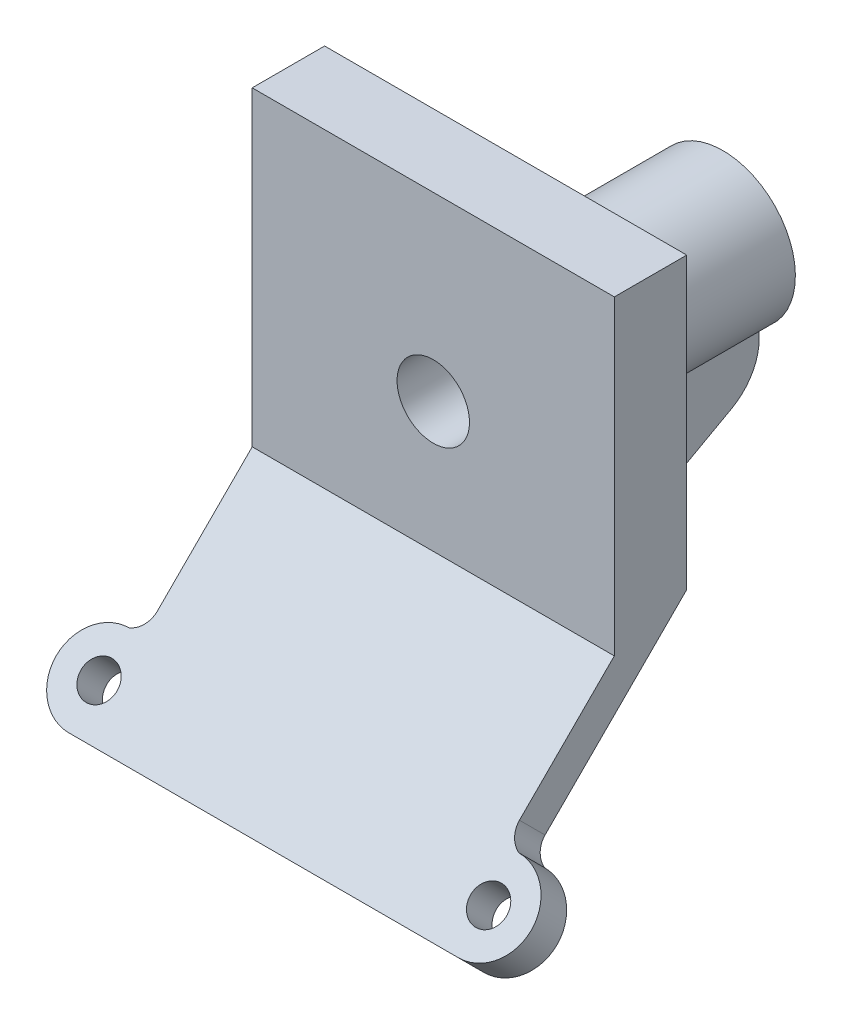
ISO-10303-21;
HEADER;
FILE_DESCRIPTION(('STEP AP214'),'2;1');
FILE_NAME('part.step','',(''),(''),'','','');
FILE_SCHEMA(('AUTOMOTIVE_DESIGN { 1 0 10303 214 1 1 1 1 }'));
ENDSEC;
DATA;
#1=APPLICATION_CONTEXT('core data for automotive mechanical design processes');
#2=APPLICATION_PROTOCOL_DEFINITION('international standard','automotive_design',2000,#1);
#3=PRODUCT_CONTEXT('',#1,'mechanical');
#4=PRODUCT('Part','Part','',(#3));
#5=PRODUCT_RELATED_PRODUCT_CATEGORY('part','',(#4));
#6=PRODUCT_DEFINITION_FORMATION('','',#4);
#7=PRODUCT_DEFINITION_CONTEXT('part definition',#1,'design');
#8=PRODUCT_DEFINITION('design','',#6,#7);
#9=PRODUCT_DEFINITION_SHAPE('','',#8);
#10=(LENGTH_UNIT() NAMED_UNIT(*) SI_UNIT(.MILLI.,.METRE.));
#11=(NAMED_UNIT(*) PLANE_ANGLE_UNIT() SI_UNIT($,.RADIAN.));
#12=(NAMED_UNIT(*) SI_UNIT($,.STERADIAN.) SOLID_ANGLE_UNIT());
#13=UNCERTAINTY_MEASURE_WITH_UNIT(LENGTH_MEASURE(1.E-05),#10,'distance_accuracy_value','');
#14=(GEOMETRIC_REPRESENTATION_CONTEXT(3) GLOBAL_UNCERTAINTY_ASSIGNED_CONTEXT((#13)) GLOBAL_UNIT_ASSIGNED_CONTEXT((#10,
#11,#12)) REPRESENTATION_CONTEXT('',''));
#15=CARTESIAN_POINT('',(0.,0.,0.));
#16=DIRECTION('',(0.,0.,1.));
#17=DIRECTION('',(1.,0.,0.));
#18=AXIS2_PLACEMENT_3D('',#15,#16,#17);
#19=CARTESIAN_POINT('',(25.,50.,5.));
#20=DIRECTION('',(-1.,0.,0.));
#21=DIRECTION('',(0.,-1.,0.));
#22=AXIS2_PLACEMENT_3D('',#19,#20,#21);
#23=PLANE('',#22);
#24=DIRECTION('',(0.,-0.707106781186546,0.707106781186549));
#25=VECTOR('',#24,1.);
#26=CARTESIAN_POINT('',(25.,2.5,2.49999999999999));
#27=LINE('',#26,#25);
#28=CARTESIAN_POINT('',(25.,9.99999999999997,-5.00000000000001));
#29=VERTEX_POINT('',#28);
#30=CARTESIAN_POINT('',(25.,-9.56377576521511,14.5637757652152));
#31=VERTEX_POINT('',#30);
#32=EDGE_CURVE('E229',#29,#31,#27,.T.);
#33=ORIENTED_EDGE('',*,*,#32,.F.);
#34=DIRECTION('',(0.,1.,0.));
#35=VECTOR('',#34,1.);
#36=CARTESIAN_POINT('',(25.,50.,-5.));
#37=LINE('',#36,#35);
#38=CARTESIAN_POINT('',(25.,50.,-5.));
#39=VERTEX_POINT('',#38);
#40=EDGE_CURVE('E287',#29,#39,#37,.T.);
#41=ORIENTED_EDGE('',*,*,#40,.T.);
#42=DIRECTION('',(0.,0.,-1.));
#43=VECTOR('',#42,1.);
#44=CARTESIAN_POINT('',(25.,50.,5.));
#45=LINE('',#44,#43);
#46=CARTESIAN_POINT('',(25.,50.,5.));
#47=VERTEX_POINT('',#46);
#48=EDGE_CURVE('E291',#47,#39,#45,.T.);
#49=ORIENTED_EDGE('',*,*,#48,.F.);
#50=DIRECTION('',(0.,1.,0.));
#51=VECTOR('',#50,1.);
#52=CARTESIAN_POINT('',(25.,50.,5.));
#53=LINE('',#52,#51);
#54=CARTESIAN_POINT('',(25.,7.07106781186547,5.));
#55=VERTEX_POINT('',#54);
#56=EDGE_CURVE('E292',#55,#47,#53,.T.);
#57=ORIENTED_EDGE('',*,*,#56,.F.);
#58=DIRECTION('',(0.,-0.707106781186546,0.707106781186549));
#59=VECTOR('',#58,1.);
#60=CARTESIAN_POINT('',(25.,48.1938279161411,-36.1227601042758));
#61=LINE('',#60,#59);
#62=CARTESIAN_POINT('',(25.,-6.02824185928237,18.0993096711479));
#63=VERTEX_POINT('',#62);
#64=EDGE_CURVE('E276',#55,#63,#61,.T.);
#65=ORIENTED_EDGE('',*,*,#64,.T.);
#66=DIRECTION('',(0.,-0.707106781186549,-0.707106781186546));
#67=VECTOR('',#66,1.);
#68=CARTESIAN_POINT('',(25.,-6.02824185928237,18.0993096711479));
#69=LINE('',#68,#67);
#70=EDGE_CURVE('E239',#63,#31,#69,.T.);
#71=ORIENTED_EDGE('',*,*,#70,.T.);
#72=EDGE_LOOP('',(#33,#41,#49,#57,#65,#71));
#73=FACE_BOUND('',#72,.T.);
#74=ADVANCED_FACE('F37',(#73),#23,.F.);
#75=CARTESIAN_POINT('',(-25.,50.,5.));
#76=DIRECTION('',(0.,-1.,0.));
#77=DIRECTION('',(0.,0.,-1.));
#78=AXIS2_PLACEMENT_3D('',#75,#76,#77);
#79=PLANE('',#78);
#80=DIRECTION('',(-1.,0.,0.));
#81=VECTOR('',#80,1.);
#82=CARTESIAN_POINT('',(-25.,50.,-5.));
#83=LINE('',#82,#81);
#84=CARTESIAN_POINT('',(-25.,50.,-5.));
#85=VERTEX_POINT('',#84);
#86=EDGE_CURVE('E302',#39,#85,#83,.T.);
#87=ORIENTED_EDGE('',*,*,#86,.T.);
#88=DIRECTION('',(0.,0.,-1.));
#89=VECTOR('',#88,1.);
#90=CARTESIAN_POINT('',(-25.,50.,5.));
#91=LINE('',#90,#89);
#92=CARTESIAN_POINT('',(-25.,50.,5.));
#93=VERTEX_POINT('',#92);
#94=EDGE_CURVE('E300',#93,#85,#91,.T.);
#95=ORIENTED_EDGE('',*,*,#94,.F.);
#96=DIRECTION('',(-1.,0.,0.));
#97=VECTOR('',#96,1.);
#98=CARTESIAN_POINT('',(-25.,50.,5.));
#99=LINE('',#98,#97);
#100=EDGE_CURVE('E294',#47,#93,#99,.T.);
#101=ORIENTED_EDGE('',*,*,#100,.F.);
#102=ORIENTED_EDGE('',*,*,#48,.T.);
#103=EDGE_LOOP('',(#87,#95,#101,#102));
#104=FACE_BOUND('',#103,.T.);
#105=ADVANCED_FACE('F344',(#104),#79,.F.);
#106=CARTESIAN_POINT('',(-25.,0.,5.));
#107=DIRECTION('',(1.,0.,0.));
#108=DIRECTION('',(0.,1.,0.));
#109=AXIS2_PLACEMENT_3D('',#106,#107,#108);
#110=PLANE('',#109);
#111=DIRECTION('',(0.,-1.,0.));
#112=VECTOR('',#111,1.);
#113=CARTESIAN_POINT('',(-25.,0.,-5.));
#114=LINE('',#113,#112);
#115=CARTESIAN_POINT('',(-25.,9.99999999999998,-5.00000000000001));
#116=VERTEX_POINT('',#115);
#117=EDGE_CURVE('E295',#85,#116,#114,.T.);
#118=ORIENTED_EDGE('',*,*,#117,.T.);
#119=DIRECTION('',(0.,-0.707106781186546,0.707106781186549));
#120=VECTOR('',#119,1.);
#121=CARTESIAN_POINT('',(-25.,2.5,2.49999999999999));
#122=LINE('',#121,#120);
#123=CARTESIAN_POINT('',(-25.,-9.56377576521511,14.5637757652152));
#124=VERTEX_POINT('',#123);
#125=EDGE_CURVE('E240',#116,#124,#122,.T.);
#126=ORIENTED_EDGE('',*,*,#125,.T.);
#127=DIRECTION('',(0.,-0.707106781186549,-0.707106781186546));
#128=VECTOR('',#127,1.);
#129=CARTESIAN_POINT('',(-25.,-6.02824185928237,18.0993096711479));
#130=LINE('',#129,#128);
#131=CARTESIAN_POINT('',(-25.,-6.02824185928237,18.0993096711479));
#132=VERTEX_POINT('',#131);
#133=EDGE_CURVE('E269',#132,#124,#130,.T.);
#134=ORIENTED_EDGE('',*,*,#133,.F.);
#135=DIRECTION('',(0.,-0.707106781186546,0.707106781186549));
#136=VECTOR('',#135,1.);
#137=CARTESIAN_POINT('',(-25.,48.1938279161411,-36.1227601042758));
#138=LINE('',#137,#136);
#139=CARTESIAN_POINT('',(-25.,7.07106781186546,5.));
#140=VERTEX_POINT('',#139);
#141=EDGE_CURVE('E274',#140,#132,#138,.T.);
#142=ORIENTED_EDGE('',*,*,#141,.F.);
#143=DIRECTION('',(0.,-1.,0.));
#144=VECTOR('',#143,1.);
#145=CARTESIAN_POINT('',(-25.,0.,5.));
#146=LINE('',#145,#144);
#147=EDGE_CURVE('E297',#93,#140,#146,.T.);
#148=ORIENTED_EDGE('',*,*,#147,.F.);
#149=ORIENTED_EDGE('',*,*,#94,.T.);
#150=EDGE_LOOP('',(#118,#126,#134,#142,#148,#149));
#151=FACE_BOUND('',#150,.T.);
#152=ADVANCED_FACE('F350',(#151),#110,.F.);
#153=CARTESIAN_POINT('',(0.,0.,5.));
#154=DIRECTION('',(0.,0.,-1.));
#155=DIRECTION('',(-1.,0.,0.));
#156=AXIS2_PLACEMENT_3D('',#153,#154,#155);
#157=PLANE('',#156);
#158=CARTESIAN_POINT('',(0.,25.,5.));
#159=DIRECTION('',(0.,0.,1.));
#160=DIRECTION('',(1.,0.,0.));
#161=AXIS2_PLACEMENT_3D('',#158,#159,#160);
#162=CIRCLE('',#161,5.);
#163=CARTESIAN_POINT('',(5.,25.,5.));
#164=VERTEX_POINT('',#163);
#165=EDGE_CURVE('E278',#164,#164,#162,.T.);
#166=ORIENTED_EDGE('',*,*,#165,.F.);
#167=EDGE_LOOP('',(#166));
#168=FACE_BOUND('',#167,.T.);
#169=ORIENTED_EDGE('',*,*,#100,.T.);
#170=ORIENTED_EDGE('',*,*,#147,.T.);
#171=DIRECTION('',(1.,0.,0.));
#172=VECTOR('',#171,1.);
#173=CARTESIAN_POINT('',(-25.,7.07106781186547,5.));
#174=LINE('',#173,#172);
#175=EDGE_CURVE('E272',#140,#55,#174,.T.);
#176=ORIENTED_EDGE('',*,*,#175,.T.);
#177=ORIENTED_EDGE('',*,*,#56,.T.);
#178=EDGE_LOOP('',(#169,#170,#176,#177));
#179=FACE_BOUND('',#178,.T.);
#180=ADVANCED_FACE('F367',(#168,#179),#157,.F.);
#181=CARTESIAN_POINT('',(0.,0.,-5.));
#182=DIRECTION('',(0.,0.,-1.));
#183=DIRECTION('',(-1.,0.,0.));
#184=AXIS2_PLACEMENT_3D('',#181,#182,#183);
#185=PLANE('',#184);
#186=DIRECTION('',(0.,-1.,0.));
#187=VECTOR('',#186,1.);
#188=CARTESIAN_POINT('',(5.,0.,-5.));
#189=LINE('',#188,#187);
#190=CARTESIAN_POINT('',(5.,16.3397459621556,-5.));
#191=VERTEX_POINT('',#190);
#192=CARTESIAN_POINT('',(5.,9.99999999999997,-5.));
#193=VERTEX_POINT('',#192);
#194=EDGE_CURVE('E212',#191,#193,#189,.T.);
#195=ORIENTED_EDGE('',*,*,#194,.F.);
#196=CARTESIAN_POINT('',(0.,25.,-5.));
#197=DIRECTION('',(0.,0.,-1.));
#198=DIRECTION('',(-1.,0.,0.));
#199=AXIS2_PLACEMENT_3D('',#196,#197,#198);
#200=CIRCLE('',#199,10.);
#201=CARTESIAN_POINT('',(-5.,16.3397459621556,-5.));
#202=VERTEX_POINT('',#201);
#203=EDGE_CURVE('E288',#202,#191,#200,.T.);
#204=ORIENTED_EDGE('',*,*,#203,.F.);
#205=DIRECTION('',(0.,-1.,0.));
#206=VECTOR('',#205,1.);
#207=CARTESIAN_POINT('',(-5.,0.,-5.));
#208=LINE('',#207,#206);
#209=CARTESIAN_POINT('',(-5.,9.99999999999997,-5.00000000000001));
#210=VERTEX_POINT('',#209);
#211=EDGE_CURVE('E205',#202,#210,#208,.T.);
#212=ORIENTED_EDGE('',*,*,#211,.T.);
#213=DIRECTION('',(1.,0.,0.));
#214=VECTOR('',#213,1.);
#215=CARTESIAN_POINT('',(0.,9.99999999999997,-5.));
#216=LINE('',#215,#214);
#217=EDGE_CURVE('E310',#116,#210,#216,.T.);
#218=ORIENTED_EDGE('',*,*,#217,.F.);
#219=ORIENTED_EDGE('',*,*,#117,.F.);
#220=ORIENTED_EDGE('',*,*,#86,.F.);
#221=ORIENTED_EDGE('',*,*,#40,.F.);
#222=EDGE_CURVE('E290',#193,#29,#216,.T.);
#223=ORIENTED_EDGE('',*,*,#222,.F.);
#224=EDGE_LOOP('',(#195,#204,#212,#218,#219,#220,#221,#223));
#225=FACE_BOUND('',#224,.T.);
#226=ADVANCED_FACE('F359',(#225),#185,.T.);
#227=CARTESIAN_POINT('',(0.,25.,-35.));
#228=DIRECTION('',(0.,0.,1.));
#229=DIRECTION('',(1.,0.,0.));
#230=AXIS2_PLACEMENT_3D('',#227,#228,#229);
#231=CYLINDRICAL_SURFACE('',#230,10.);
#232=ORIENTED_EDGE('',*,*,#203,.T.);
#233=DIRECTION('',(0.,0.,1.));
#234=VECTOR('',#233,1.);
#235=CARTESIAN_POINT('',(5.,16.3397459621556,-35.));
#236=LINE('',#235,#234);
#237=CARTESIAN_POINT('',(5.,16.3397459621556,-34.9919759113786));
#238=VERTEX_POINT('',#237);
#239=EDGE_CURVE('E51',#191,#238,#236,.F.);
#240=ORIENTED_EDGE('',*,*,#239,.T.);
#241=CARTESIAN_POINT('',(0.,25.,-34.9382764772955));
#242=DIRECTION('',(0.,0.00620055734505954,-0.999980776359531));
#243=DIRECTION('',(0.,0.999980776359531,0.00620055734505954));
#244=AXIS2_PLACEMENT_3D('',#241,#242,#243);
#245=ELLIPSE('',#244,10.0001922401002,10.);
#246=CARTESIAN_POINT('',(0.954725076891164,15.0456793286756,-35.));
#247=VERTEX_POINT('',#246);
#248=EDGE_CURVE('E216',#238,#247,#245,.T.);
#249=ORIENTED_EDGE('',*,*,#248,.T.);
#250=CARTESIAN_POINT('',(0.,25.,-35.));
#251=DIRECTION('',(0.,0.,-1.));
#252=DIRECTION('',(-1.,0.,0.));
#253=AXIS2_PLACEMENT_3D('',#250,#251,#252);
#254=CIRCLE('',#253,10.);
#255=CARTESIAN_POINT('',(-0.954725076891164,15.0456793286756,-35.));
#256=VERTEX_POINT('',#255);
#257=EDGE_CURVE('E282',#256,#247,#254,.T.);
#258=ORIENTED_EDGE('',*,*,#257,.F.);
#259=CARTESIAN_POINT('',(-5.,16.3397459621556,-34.9919759113786));
#260=VERTEX_POINT('',#259);
#261=EDGE_CURVE('E58',#256,#260,#245,.T.);
#262=ORIENTED_EDGE('',*,*,#261,.T.);
#263=DIRECTION('',(0.,0.,1.));
#264=VECTOR('',#263,1.);
#265=CARTESIAN_POINT('',(-5.,16.3397459621556,-35.));
#266=LINE('',#265,#264);
#267=EDGE_CURVE('E210',#202,#260,#266,.F.);
#268=ORIENTED_EDGE('',*,*,#267,.F.);
#269=EDGE_LOOP('',(#232,#240,#249,#258,#262,#268));
#270=FACE_BOUND('',#269,.T.);
#271=ADVANCED_FACE('F406',(#270),#231,.T.);
#272=CARTESIAN_POINT('',(0.,25.,-35.));
#273=DIRECTION('',(0.,0.,-1.));
#274=DIRECTION('',(-1.,0.,0.));
#275=AXIS2_PLACEMENT_3D('',#272,#273,#274);
#276=PLANE('',#275);
#277=DIRECTION('',(1.,0.,0.));
#278=VECTOR('',#277,1.);
#279=CARTESIAN_POINT('',(0.,15.0456793286756,-35.));
#280=LINE('',#279,#278);
#281=EDGE_CURVE('E190',#256,#247,#280,.T.);
#282=ORIENTED_EDGE('',*,*,#281,.F.);
#283=ORIENTED_EDGE('',*,*,#257,.T.);
#284=EDGE_LOOP('',(#282,#283));
#285=FACE_BOUND('',#284,.T.);
#286=CARTESIAN_POINT('',(0.,25.,-35.));
#287=DIRECTION('',(0.,0.,1.));
#288=DIRECTION('',(1.,0.,0.));
#289=AXIS2_PLACEMENT_3D('',#286,#287,#288);
#290=CIRCLE('',#289,5.);
#291=CARTESIAN_POINT('',(5.,25.,-35.));
#292=VERTEX_POINT('',#291);
#293=EDGE_CURVE('E279',#292,#292,#290,.T.);
#294=ORIENTED_EDGE('',*,*,#293,.T.);
#295=EDGE_LOOP('',(#294));
#296=FACE_BOUND('',#295,.T.);
#297=ADVANCED_FACE('F410',(#285,#296),#276,.T.);
#298=CARTESIAN_POINT('',(0.,25.,-35.));
#299=DIRECTION('',(0.,0.,1.));
#300=DIRECTION('',(1.,0.,0.));
#301=AXIS2_PLACEMENT_3D('',#298,#299,#300);
#302=CYLINDRICAL_SURFACE('',#301,5.);
#303=ORIENTED_EDGE('',*,*,#293,.F.);
#304=EDGE_LOOP('',(#303));
#305=FACE_BOUND('',#304,.T.);
#306=ORIENTED_EDGE('',*,*,#165,.T.);
#307=EDGE_LOOP('',(#306));
#308=FACE_BOUND('',#307,.T.);
#309=ADVANCED_FACE('F413',(#305,#308),#302,.F.);
#310=CARTESIAN_POINT('',(-25.,48.1938279161411,-36.1227601042758));
#311=DIRECTION('',(0.,-0.707106781186549,-0.707106781186546));
#312=DIRECTION('',(0.,0.707106781186546,-0.707106781186549));
#313=AXIS2_PLACEMENT_3D('',#310,#311,#312);
#314=PLANE('',#313);
#315=CARTESIAN_POINT('',(26.8946348603925,-12.1799543555879,24.2510221674534));
#316=DIRECTION('',(0.,-0.707106781186549,-0.707106781186546));
#317=DIRECTION('',(0.,-0.707106781186546,0.707106781186549));
#318=AXIS2_PLACEMENT_3D('',#315,#316,#317);
#319=CIRCLE('',#318,2.5);
#320=CARTESIAN_POINT('',(26.8946348603925,-13.9477213085542,26.0187891204198));
#321=VERTEX_POINT('',#320);
#322=EDGE_CURVE('E218',#321,#321,#319,.T.);
#323=ORIENTED_EDGE('',*,*,#322,.T.);
#324=EDGE_LOOP('',(#323));
#325=FACE_BOUND('',#324,.T.);
#326=ORIENTED_EDGE('',*,*,#64,.F.);
#327=ORIENTED_EDGE('',*,*,#175,.F.);
#328=ORIENTED_EDGE('',*,*,#141,.T.);
#329=CARTESIAN_POINT('',(-28.,-6.02824185928237,18.0993096711479));
#330=DIRECTION('',(0.,0.707106781186549,0.707106781186546));
#331=DIRECTION('',(0.,-0.707106781186546,0.707106781186549));
#332=AXIS2_PLACEMENT_3D('',#329,#330,#331);
#333=CIRCLE('',#332,3.);
#334=CARTESIAN_POINT('',(-26.8946348603925,-8.00031791107909,20.0713857229446));
#335=VERTEX_POINT('',#334);
#336=EDGE_CURVE('E226',#132,#335,#333,.F.);
#337=ORIENTED_EDGE('',*,*,#336,.T.);
#338=CARTESIAN_POINT('',(-26.8946348603925,-12.1799543555879,24.2510221674534));
#339=DIRECTION('',(0.,0.707106781186549,0.707106781186546));
#340=DIRECTION('',(0.,-0.707106781186546,0.707106781186549));
#341=AXIS2_PLACEMENT_3D('',#338,#339,#340);
#342=CIRCLE('',#341,5.91089854561318);
#343=CARTESIAN_POINT('',(-26.8946348603925,-16.3595908000966,28.4306586119622));
#344=VERTEX_POINT('',#343);
#345=EDGE_CURVE('E228',#335,#344,#342,.T.);
#346=ORIENTED_EDGE('',*,*,#345,.T.);
#347=DIRECTION('',(1.,0.,0.));
#348=VECTOR('',#347,1.);
#349=CARTESIAN_POINT('',(0.,-16.3595908000966,28.4306586119622));
#350=LINE('',#349,#348);
#351=CARTESIAN_POINT('',(26.8946348603925,-16.3595908000966,28.4306586119622));
#352=VERTEX_POINT('',#351);
#353=EDGE_CURVE('E231',#344,#352,#350,.T.);
#354=ORIENTED_EDGE('',*,*,#353,.T.);
#355=CARTESIAN_POINT('',(26.8946348603925,-12.1799543555879,24.2510221674534));
#356=DIRECTION('',(0.,0.707106781186549,0.707106781186546));
#357=DIRECTION('',(0.,-0.707106781186546,0.707106781186549));
#358=AXIS2_PLACEMENT_3D('',#355,#356,#357);
#359=CIRCLE('',#358,5.91089854561318);
#360=CARTESIAN_POINT('',(26.8946348603925,-8.00031791107909,20.0713857229446));
#361=VERTEX_POINT('',#360);
#362=EDGE_CURVE('E233',#361,#352,#359,.F.);
#363=ORIENTED_EDGE('',*,*,#362,.F.);
#364=CARTESIAN_POINT('',(28.,-6.02824185928237,18.0993096711479));
#365=DIRECTION('',(0.,0.707106781186549,0.707106781186546));
#366=DIRECTION('',(0.,-0.707106781186546,0.707106781186549));
#367=AXIS2_PLACEMENT_3D('',#364,#365,#366);
#368=CIRCLE('',#367,3.);
#369=EDGE_CURVE('E236',#63,#361,#368,.T.);
#370=ORIENTED_EDGE('',*,*,#369,.F.);
#371=EDGE_LOOP('',(#326,#327,#328,#337,#346,#354,#363,#370));
#372=FACE_BOUND('',#371,.T.);
#373=CARTESIAN_POINT('',(-26.8946348603925,-12.1799543555879,24.2510221674534));
#374=DIRECTION('',(0.,0.707106781186549,0.707106781186546));
#375=DIRECTION('',(0.,-0.707106781186546,0.707106781186549));
#376=AXIS2_PLACEMENT_3D('',#373,#374,#375);
#377=CIRCLE('',#376,2.5);
#378=CARTESIAN_POINT('',(-26.8946348603925,-13.9477213085542,26.0187891204198));
#379=VERTEX_POINT('',#378);
#380=EDGE_CURVE('E222',#379,#379,#377,.T.);
#381=ORIENTED_EDGE('',*,*,#380,.F.);
#382=EDGE_LOOP('',(#381));
#383=FACE_BOUND('',#382,.T.);
#384=ADVANCED_FACE('F372',(#325,#372,#383),#314,.F.);
#385=CARTESIAN_POINT('',(-28.,-6.02824185928237,18.0993096711479));
#386=DIRECTION('',(0.,-0.707106781186549,-0.707106781186546));
#387=DIRECTION('',(0.,0.707106781186546,-0.707106781186549));
#388=AXIS2_PLACEMENT_3D('',#385,#386,#387);
#389=CYLINDRICAL_SURFACE('',#388,3.);
#390=CARTESIAN_POINT('',(-28.,-9.56377576521511,14.5637757652151));
#391=DIRECTION('',(0.,0.707106781186549,0.707106781186546));
#392=DIRECTION('',(0.,-0.707106781186546,0.707106781186549));
#393=AXIS2_PLACEMENT_3D('',#390,#391,#392);
#394=CIRCLE('',#393,3.);
#395=CARTESIAN_POINT('',(-26.8946348603925,-11.5358518170118,16.5358518170119));
#396=VERTEX_POINT('',#395);
#397=EDGE_CURVE('E243',#124,#396,#394,.F.);
#398=ORIENTED_EDGE('',*,*,#397,.T.);
#399=DIRECTION('',(0.,-0.707106781186549,-0.707106781186546));
#400=VECTOR('',#399,1.);
#401=CARTESIAN_POINT('',(-26.8946348603925,-8.00031791107909,20.0713857229446));
#402=LINE('',#401,#400);
#403=EDGE_CURVE('E266',#335,#396,#402,.T.);
#404=ORIENTED_EDGE('',*,*,#403,.F.);
#405=ORIENTED_EDGE('',*,*,#336,.F.);
#406=ORIENTED_EDGE('',*,*,#133,.T.);
#407=EDGE_LOOP('',(#398,#404,#405,#406));
#408=FACE_BOUND('',#407,.T.);
#409=ADVANCED_FACE('F394',(#408),#389,.F.);
#410=CARTESIAN_POINT('',(-26.8946348603925,-12.1799543555879,24.2510221674534));
#411=DIRECTION('',(0.,-0.707106781186549,-0.707106781186546));
#412=DIRECTION('',(0.,0.707106781186546,-0.707106781186549));
#413=AXIS2_PLACEMENT_3D('',#410,#411,#412);
#414=CYLINDRICAL_SURFACE('',#413,5.91089854561318);
#415=CARTESIAN_POINT('',(-26.8946348603925,-15.7154882615206,20.7154882615207));
#416=DIRECTION('',(0.,0.707106781186549,0.707106781186546));
#417=DIRECTION('',(0.,-0.707106781186546,0.707106781186549));
#418=AXIS2_PLACEMENT_3D('',#415,#416,#417);
#419=CIRCLE('',#418,5.91089854561318);
#420=CARTESIAN_POINT('',(-26.8946348603925,-19.8951247060294,24.8951247060295));
#421=VERTEX_POINT('',#420);
#422=EDGE_CURVE('E245',#396,#421,#419,.T.);
#423=ORIENTED_EDGE('',*,*,#422,.T.);
#424=DIRECTION('',(0.,-0.707106781186549,-0.707106781186546));
#425=VECTOR('',#424,1.);
#426=CARTESIAN_POINT('',(-26.8946348603925,-16.3595908000966,28.4306586119622));
#427=LINE('',#426,#425);
#428=EDGE_CURVE('E263',#344,#421,#427,.T.);
#429=ORIENTED_EDGE('',*,*,#428,.F.);
#430=ORIENTED_EDGE('',*,*,#345,.F.);
#431=ORIENTED_EDGE('',*,*,#403,.T.);
#432=EDGE_LOOP('',(#423,#429,#430,#431));
#433=FACE_BOUND('',#432,.T.);
#434=ADVANCED_FACE('F389',(#433),#414,.T.);
#435=CARTESIAN_POINT('',(0.,-16.3595908000966,28.4306586119622));
#436=DIRECTION('',(0.,0.707106781186546,-0.707106781186549));
#437=DIRECTION('',(0.,0.707106781186549,0.707106781186546));
#438=AXIS2_PLACEMENT_3D('',#435,#436,#437);
#439=PLANE('',#438);
#440=DIRECTION('',(0.,-0.707106781186549,-0.707106781186546));
#441=VECTOR('',#440,1.);
#442=CARTESIAN_POINT('',(26.8946348603925,-16.3595908000966,28.4306586119622));
#443=LINE('',#442,#441);
#444=CARTESIAN_POINT('',(26.8946348603925,-19.8951247060294,24.8951247060295));
#445=VERTEX_POINT('',#444);
#446=EDGE_CURVE('E261',#352,#445,#443,.T.);
#447=ORIENTED_EDGE('',*,*,#446,.F.);
#448=ORIENTED_EDGE('',*,*,#353,.F.);
#449=ORIENTED_EDGE('',*,*,#428,.T.);
#450=DIRECTION('',(1.,0.,0.));
#451=VECTOR('',#450,1.);
#452=CARTESIAN_POINT('',(0.,-19.8951247060294,24.8951247060295));
#453=LINE('',#452,#451);
#454=EDGE_CURVE('E247',#421,#445,#453,.T.);
#455=ORIENTED_EDGE('',*,*,#454,.T.);
#456=EDGE_LOOP('',(#447,#448,#449,#455));
#457=FACE_BOUND('',#456,.T.);
#458=ADVANCED_FACE('F385',(#457),#439,.F.);
#459=CARTESIAN_POINT('',(26.8946348603925,-12.1799543555879,24.2510221674534));
#460=DIRECTION('',(0.,-0.707106781186549,-0.707106781186546));
#461=DIRECTION('',(0.,0.707106781186546,-0.707106781186549));
#462=AXIS2_PLACEMENT_3D('',#459,#460,#461);
#463=CYLINDRICAL_SURFACE('',#462,5.91089854561318);
#464=CARTESIAN_POINT('',(26.8946348603925,-15.7154882615206,20.7154882615207));
#465=DIRECTION('',(0.,0.707106781186549,0.707106781186546));
#466=DIRECTION('',(0.,-0.707106781186546,0.707106781186549));
#467=AXIS2_PLACEMENT_3D('',#464,#465,#466);
#468=CIRCLE('',#467,5.91089854561318);
#469=CARTESIAN_POINT('',(26.8946348603925,-11.5358518170118,16.5358518170119));
#470=VERTEX_POINT('',#469);
#471=EDGE_CURVE('E250',#470,#445,#468,.F.);
#472=ORIENTED_EDGE('',*,*,#471,.F.);
#473=DIRECTION('',(0.,-0.707106781186549,-0.707106781186546));
#474=VECTOR('',#473,1.);
#475=CARTESIAN_POINT('',(26.8946348603925,-8.00031791107909,20.0713857229446));
#476=LINE('',#475,#474);
#477=EDGE_CURVE('E259',#361,#470,#476,.T.);
#478=ORIENTED_EDGE('',*,*,#477,.F.);
#479=ORIENTED_EDGE('',*,*,#362,.T.);
#480=ORIENTED_EDGE('',*,*,#446,.T.);
#481=EDGE_LOOP('',(#472,#478,#479,#480));
#482=FACE_BOUND('',#481,.T.);
#483=ADVANCED_FACE('F381',(#482),#463,.T.);
#484=CARTESIAN_POINT('',(28.,-6.02824185928237,18.0993096711479));
#485=DIRECTION('',(0.,-0.707106781186549,-0.707106781186546));
#486=DIRECTION('',(0.,0.707106781186546,-0.707106781186549));
#487=AXIS2_PLACEMENT_3D('',#484,#485,#486);
#488=CYLINDRICAL_SURFACE('',#487,3.);
#489=CARTESIAN_POINT('',(28.,-9.56377576521511,14.5637757652151));
#490=DIRECTION('',(0.,0.707106781186549,0.707106781186546));
#491=DIRECTION('',(0.,-0.707106781186546,0.707106781186549));
#492=AXIS2_PLACEMENT_3D('',#489,#490,#491);
#493=CIRCLE('',#492,3.);
#494=EDGE_CURVE('E253',#31,#470,#493,.T.);
#495=ORIENTED_EDGE('',*,*,#494,.F.);
#496=ORIENTED_EDGE('',*,*,#70,.F.);
#497=ORIENTED_EDGE('',*,*,#369,.T.);
#498=ORIENTED_EDGE('',*,*,#477,.T.);
#499=EDGE_LOOP('',(#495,#496,#497,#498));
#500=FACE_BOUND('',#499,.T.);
#501=ADVANCED_FACE('F376',(#500),#488,.F.);
#502=CARTESIAN_POINT('',(0.,2.5,2.49999999999999));
#503=DIRECTION('',(0.,0.707106781186549,0.707106781186546));
#504=DIRECTION('',(0.,-0.707106781186546,0.707106781186549));
#505=AXIS2_PLACEMENT_3D('',#502,#503,#504);
#506=PLANE('',#505);
#507=CARTESIAN_POINT('',(26.8946348603925,-15.7154882615206,20.7154882615207));
#508=DIRECTION('',(0.,0.707106781186549,0.707106781186546));
#509=DIRECTION('',(0.,-0.707106781186546,0.707106781186549));
#510=AXIS2_PLACEMENT_3D('',#507,#508,#509);
#511=CIRCLE('',#510,2.5);
#512=CARTESIAN_POINT('',(26.8946348603925,-17.483255214487,22.483255214487));
#513=VERTEX_POINT('',#512);
#514=EDGE_CURVE('E221',#513,#513,#511,.F.);
#515=ORIENTED_EDGE('',*,*,#514,.F.);
#516=EDGE_LOOP('',(#515));
#517=FACE_BOUND('',#516,.T.);
#518=CARTESIAN_POINT('',(-26.8946348603925,-15.7154882615206,20.7154882615207));
#519=DIRECTION('',(0.,0.707106781186549,0.707106781186546));
#520=DIRECTION('',(0.,-0.707106781186546,0.707106781186549));
#521=AXIS2_PLACEMENT_3D('',#518,#519,#520);
#522=CIRCLE('',#521,2.5);
#523=CARTESIAN_POINT('',(-26.8946348603925,-17.483255214487,22.483255214487));
#524=VERTEX_POINT('',#523);
#525=EDGE_CURVE('E225',#524,#524,#522,.T.);
#526=ORIENTED_EDGE('',*,*,#525,.T.);
#527=EDGE_LOOP('',(#526));
#528=FACE_BOUND('',#527,.T.);
#529=DIRECTION('',(-1.,0.,0.));
#530=VECTOR('',#529,1.);
#531=CARTESIAN_POINT('',(0.,-19.8941530486316,24.8941530486317));
#532=LINE('',#531,#530);
#533=CARTESIAN_POINT('',(-5.,-19.8941530486316,24.8941530486317));
#534=VERTEX_POINT('',#533);
#535=CARTESIAN_POINT('',(5.,-19.8941530486316,24.8941530486317));
#536=VERTEX_POINT('',#535);
#537=EDGE_CURVE('E44',#534,#536,#532,.F.);
#538=ORIENTED_EDGE('',*,*,#537,.T.);
#539=DIRECTION('',(0.,0.707106781186546,-0.707106781186549));
#540=VECTOR('',#539,1.);
#541=CARTESIAN_POINT('',(5.,2.5,2.49999999999999));
#542=LINE('',#541,#540);
#543=EDGE_CURVE('E11',#536,#193,#542,.T.);
#544=ORIENTED_EDGE('',*,*,#543,.T.);
#545=ORIENTED_EDGE('',*,*,#222,.T.);
#546=ORIENTED_EDGE('',*,*,#32,.T.);
#547=ORIENTED_EDGE('',*,*,#494,.T.);
#548=ORIENTED_EDGE('',*,*,#471,.T.);
#549=ORIENTED_EDGE('',*,*,#454,.F.);
#550=ORIENTED_EDGE('',*,*,#422,.F.);
#551=ORIENTED_EDGE('',*,*,#397,.F.);
#552=ORIENTED_EDGE('',*,*,#125,.F.);
#553=ORIENTED_EDGE('',*,*,#217,.T.);
#554=DIRECTION('',(0.,0.707106781186546,-0.707106781186549));
#555=VECTOR('',#554,1.);
#556=CARTESIAN_POINT('',(-5.,2.5,2.49999999999999));
#557=LINE('',#556,#555);
#558=EDGE_CURVE('E312',#534,#210,#557,.T.);
#559=ORIENTED_EDGE('',*,*,#558,.F.);
#560=EDGE_LOOP('',(#538,#544,#545,#546,#547,#548,#549,#550,#551,#552,#553,#559));
#561=FACE_BOUND('',#560,.T.);
#562=ADVANCED_FACE('F320',(#517,#528,#561),#506,.F.);
#563=CARTESIAN_POINT('',(-26.8946348603925,-45.6630506145354,-9.23207409149397));
#564=DIRECTION('',(0.,0.707106781186549,0.707106781186546));
#565=DIRECTION('',(0.,-0.707106781186546,0.707106781186549));
#566=AXIS2_PLACEMENT_3D('',#563,#564,#565);
#567=CYLINDRICAL_SURFACE('',#566,2.5);
#568=ORIENTED_EDGE('',*,*,#380,.T.);
#569=EDGE_LOOP('',(#568));
#570=FACE_BOUND('',#569,.T.);
#571=ORIENTED_EDGE('',*,*,#525,.F.);
#572=EDGE_LOOP('',(#571));
#573=FACE_BOUND('',#572,.T.);
#574=ADVANCED_FACE('F433',(#570,#573),#567,.F.);
#575=CARTESIAN_POINT('',(26.8946348603925,-45.6630506145354,-9.23207409149397));
#576=DIRECTION('',(0.,0.707106781186549,0.707106781186546));
#577=DIRECTION('',(0.,-0.707106781186546,0.707106781186549));
#578=AXIS2_PLACEMENT_3D('',#575,#576,#577);
#579=CYLINDRICAL_SURFACE('',#578,2.5);
#580=ORIENTED_EDGE('',*,*,#322,.F.);
#581=EDGE_LOOP('',(#580));
#582=FACE_BOUND('',#581,.T.);
#583=ORIENTED_EDGE('',*,*,#514,.T.);
#584=EDGE_LOOP('',(#583));
#585=FACE_BOUND('',#584,.T.);
#586=ADVANCED_FACE('F340',(#582,#585),#579,.F.);
#587=CARTESIAN_POINT('',(0.,15.0456793286756,-35.));
#588=DIRECTION('',(0.,0.00620055734505954,-0.999980776359531));
#589=DIRECTION('',(0.,0.999980776359531,0.00620055734505954));
#590=AXIS2_PLACEMENT_3D('',#587,#588,#589);
#591=PLANE('',#590);
#592=ORIENTED_EDGE('',*,*,#248,.F.);
#593=DIRECTION('',(0.,0.999980776359531,0.00620055734505954));
#594=VECTOR('',#593,1.);
#595=CARTESIAN_POINT('',(5.,15.0456793286756,-35.));
#596=LINE('',#595,#594);
#597=CARTESIAN_POINT('',(5.,15.0456793286756,-35.));
#598=VERTEX_POINT('',#597);
#599=EDGE_CURVE('E194',#598,#238,#596,.T.);
#600=ORIENTED_EDGE('',*,*,#599,.F.);
#601=EDGE_CURVE('E187',#247,#598,#280,.T.);
#602=ORIENTED_EDGE('',*,*,#601,.F.);
#603=EDGE_LOOP('',(#592,#600,#602));
#604=FACE_BOUND('',#603,.T.);
#605=ADVANCED_FACE('F333',(#604),#591,.T.);
#606=ORIENTED_EDGE('',*,*,#261,.F.);
#607=CARTESIAN_POINT('',(-5.,15.0456793286756,-35.));
#608=VERTEX_POINT('',#607);
#609=EDGE_CURVE('E172',#608,#256,#280,.T.);
#610=ORIENTED_EDGE('',*,*,#609,.F.);
#611=DIRECTION('',(0.,0.999980776359531,0.00620055734505954));
#612=VECTOR('',#611,1.);
#613=CARTESIAN_POINT('',(-5.,15.0456793286756,-35.));
#614=LINE('',#613,#612);
#615=EDGE_CURVE('E202',#608,#260,#614,.T.);
#616=ORIENTED_EDGE('',*,*,#615,.T.);
#617=EDGE_LOOP('',(#606,#610,#616));
#618=FACE_BOUND('',#617,.T.);
#619=ADVANCED_FACE('F331',(#618),#591,.T.);
#620=CARTESIAN_POINT('',(0.,-17.5618966589352,22.6946262305799));
#621=DIRECTION('',(-1.,0.,0.));
#622=DIRECTION('',(0.,0.,1.));
#623=AXIS2_PLACEMENT_3D('',#620,#621,#622);
#624=CYLINDRICAL_SURFACE('',#623,3.20582876813605);
#625=ORIENTED_EDGE('',*,*,#537,.F.);
#626=CARTESIAN_POINT('',(-5.,-17.5618966589352,22.6946262305799));
#627=DIRECTION('',(-1.,0.,0.));
#628=DIRECTION('',(0.,0.,1.));
#629=AXIS2_PLACEMENT_3D('',#626,#627,#628);
#630=CIRCLE('',#629,3.20582876813605);
#631=CARTESIAN_POINT('',(-5.,-20.3680578440295,21.144530267783));
#632=VERTEX_POINT('',#631);
#633=EDGE_CURVE('E199',#632,#534,#630,.T.);
#634=ORIENTED_EDGE('',*,*,#633,.F.);
#635=DIRECTION('',(1.,0.,0.));
#636=VECTOR('',#635,1.);
#637=CARTESIAN_POINT('',(0.,-20.3680578440295,21.144530267783));
#638=LINE('',#637,#636);
#639=CARTESIAN_POINT('',(5.,-20.3680578440295,21.144530267783));
#640=VERTEX_POINT('',#639);
#641=EDGE_CURVE('E171',#632,#640,#638,.T.);
#642=ORIENTED_EDGE('',*,*,#641,.T.);
#643=CARTESIAN_POINT('',(5.,-17.5618966589352,22.6946262305799));
#644=DIRECTION('',(-1.,0.,0.));
#645=DIRECTION('',(0.,0.,1.));
#646=AXIS2_PLACEMENT_3D('',#643,#644,#645);
#647=CIRCLE('',#646,3.20582876813605);
#648=EDGE_CURVE('E182',#640,#536,#647,.T.);
#649=ORIENTED_EDGE('',*,*,#648,.T.);
#650=EDGE_LOOP('',(#625,#634,#642,#649));
#651=FACE_BOUND('',#650,.T.);
#652=ADVANCED_FACE('F325',(#651),#624,.T.);
#653=CARTESIAN_POINT('',(5.,15.0524376469853,-3.2846706940189));
#654=DIRECTION('',(1.,0.,0.));
#655=DIRECTION('',(0.,0.,-1.));
#656=AXIS2_PLACEMENT_3D('',#653,#654,#655);
#657=PLANE('',#656);
#658=ORIENTED_EDGE('',*,*,#239,.F.);
#659=ORIENTED_EDGE('',*,*,#194,.T.);
#660=ORIENTED_EDGE('',*,*,#543,.F.);
#661=ORIENTED_EDGE('',*,*,#648,.F.);
#662=DIRECTION('',(0.,-0.483524253760462,0.875330963707664));
#663=VECTOR('',#662,1.);
#664=CARTESIAN_POINT('',(5.,-20.3680578440295,21.144530267783));
#665=LINE('',#664,#663);
#666=CARTESIAN_POINT('',(5.,8.54034197798798,-31.1887648640654));
#667=VERTEX_POINT('',#666);
#668=EDGE_CURVE('E164',#667,#640,#665,.T.);
#669=ORIENTED_EDGE('',*,*,#668,.F.);
#670=CARTESIAN_POINT('',(5.,14.9999217847551,-27.6205562262223));
#671=DIRECTION('',(-1.,0.,0.));
#672=DIRECTION('',(0.,0.,1.));
#673=AXIS2_PLACEMENT_3D('',#670,#671,#672);
#674=CIRCLE('',#673,7.37958563627878);
#675=EDGE_CURVE('E179',#598,#667,#674,.T.);
#676=ORIENTED_EDGE('',*,*,#675,.F.);
#677=ORIENTED_EDGE('',*,*,#599,.T.);
#678=EDGE_LOOP('',(#658,#659,#660,#661,#669,#676,#677));
#679=FACE_BOUND('',#678,.T.);
#680=ADVANCED_FACE('F177',(#679),#657,.T.);
#681=CARTESIAN_POINT('',(-5.,15.0524376469853,-3.2846706940189));
#682=DIRECTION('',(1.,0.,0.));
#683=DIRECTION('',(0.,0.,-1.));
#684=AXIS2_PLACEMENT_3D('',#681,#682,#683);
#685=PLANE('',#684);
#686=ORIENTED_EDGE('',*,*,#211,.F.);
#687=ORIENTED_EDGE('',*,*,#267,.T.);
#688=ORIENTED_EDGE('',*,*,#615,.F.);
#689=CARTESIAN_POINT('',(-5.,14.9999217847551,-27.6205562262223));
#690=DIRECTION('',(-1.,0.,0.));
#691=DIRECTION('',(0.,0.,1.));
#692=AXIS2_PLACEMENT_3D('',#689,#690,#691);
#693=CIRCLE('',#692,7.37958563627878);
#694=CARTESIAN_POINT('',(-5.,8.54034197798798,-31.1887648640654));
#695=VERTEX_POINT('',#694);
#696=EDGE_CURVE('E196',#608,#695,#693,.T.);
#697=ORIENTED_EDGE('',*,*,#696,.T.);
#698=DIRECTION('',(0.,-0.483524253760462,0.875330963707664));
#699=VECTOR('',#698,1.);
#700=CARTESIAN_POINT('',(-5.,-20.3680578440295,21.144530267783));
#701=LINE('',#700,#699);
#702=EDGE_CURVE('E166',#695,#632,#701,.T.);
#703=ORIENTED_EDGE('',*,*,#702,.T.);
#704=ORIENTED_EDGE('',*,*,#633,.T.);
#705=ORIENTED_EDGE('',*,*,#558,.T.);
#706=EDGE_LOOP('',(#686,#687,#688,#697,#703,#704,#705));
#707=FACE_BOUND('',#706,.T.);
#708=ADVANCED_FACE('F328',(#707),#685,.F.);
#709=CARTESIAN_POINT('',(0.,-20.3680578440295,21.144530267783));
#710=DIRECTION('',(0.,0.875330963707664,0.483524253760462));
#711=DIRECTION('',(0.,-0.483524253760462,0.875330963707664));
#712=AXIS2_PLACEMENT_3D('',#709,#710,#711);
#713=PLANE('',#712);
#714=ORIENTED_EDGE('',*,*,#641,.F.);
#715=ORIENTED_EDGE('',*,*,#702,.F.);
#716=DIRECTION('',(1.,0.,0.));
#717=VECTOR('',#716,1.);
#718=CARTESIAN_POINT('',(0.,8.54034197798798,-31.1887648640654));
#719=LINE('',#718,#717);
#720=EDGE_CURVE('E161',#695,#667,#719,.T.);
#721=ORIENTED_EDGE('',*,*,#720,.T.);
#722=ORIENTED_EDGE('',*,*,#668,.T.);
#723=EDGE_LOOP('',(#714,#715,#721,#722));
#724=FACE_BOUND('',#723,.T.);
#725=ADVANCED_FACE('F163',(#724),#713,.F.);
#726=CARTESIAN_POINT('',(0.,14.9999217847551,-27.6205562262223));
#727=DIRECTION('',(-1.,0.,0.));
#728=DIRECTION('',(0.,0.,1.));
#729=AXIS2_PLACEMENT_3D('',#726,#727,#728);
#730=CYLINDRICAL_SURFACE('',#729,7.37958563627878);
#731=ORIENTED_EDGE('',*,*,#720,.F.);
#732=ORIENTED_EDGE('',*,*,#696,.F.);
#733=ORIENTED_EDGE('',*,*,#609,.T.);
#734=ORIENTED_EDGE('',*,*,#281,.T.);
#735=ORIENTED_EDGE('',*,*,#601,.T.);
#736=ORIENTED_EDGE('',*,*,#675,.T.);
#737=EDGE_LOOP('',(#731,#732,#733,#734,#735,#736));
#738=FACE_BOUND('',#737,.T.);
#739=ADVANCED_FACE('F184',(#738),#730,.T.);
#740=CLOSED_SHELL('',(#74,#105,#152,#180,#226,#271,#297,#309,#384,#409,#434,#458,#483,#501,#562,
#574,#586,#605,#619,#652,#680,#708,#725,#739));
#741=MANIFOLD_SOLID_BREP('B2',#740);
#742=ADVANCED_BREP_SHAPE_REPRESENTATION('',(#18,#741),#14);
#743=SHAPE_DEFINITION_REPRESENTATION(#9,#742);
ENDSEC;
END-ISO-10303-21;
